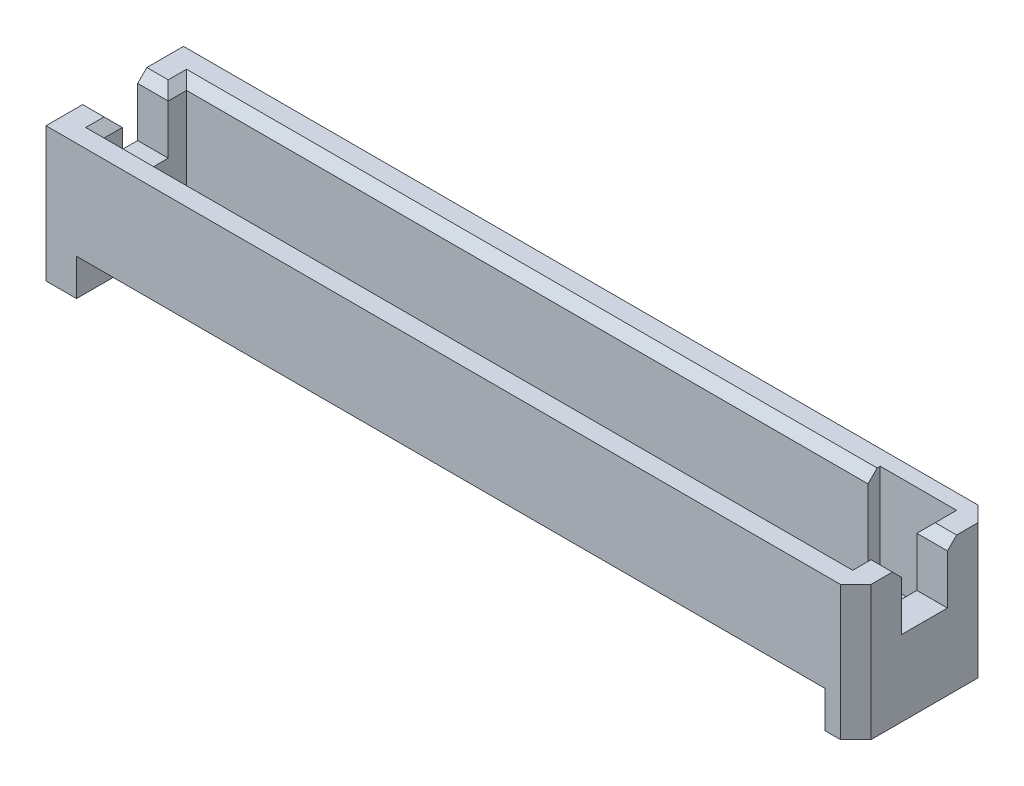
ISO-10303-21;
HEADER;
FILE_DESCRIPTION(('STEP AP214'),'2;1');
FILE_NAME('part.step','',(''),(''),'','','');
FILE_SCHEMA(('AUTOMOTIVE_DESIGN { 1 0 10303 214 1 1 1 1 }'));
ENDSEC;
DATA;
#1=APPLICATION_CONTEXT('core data for automotive mechanical design processes');
#2=APPLICATION_PROTOCOL_DEFINITION('international standard','automotive_design',2000,#1);
#3=PRODUCT_CONTEXT('',#1,'mechanical');
#4=PRODUCT('Part','Part','',(#3));
#5=PRODUCT_RELATED_PRODUCT_CATEGORY('part','',(#4));
#6=PRODUCT_DEFINITION_FORMATION('','',#4);
#7=PRODUCT_DEFINITION_CONTEXT('part definition',#1,'design');
#8=PRODUCT_DEFINITION('design','',#6,#7);
#9=PRODUCT_DEFINITION_SHAPE('','',#8);
#10=(LENGTH_UNIT() NAMED_UNIT(*) SI_UNIT(.MILLI.,.METRE.));
#11=(NAMED_UNIT(*) PLANE_ANGLE_UNIT() SI_UNIT($,.RADIAN.));
#12=(NAMED_UNIT(*) SI_UNIT($,.STERADIAN.) SOLID_ANGLE_UNIT());
#13=UNCERTAINTY_MEASURE_WITH_UNIT(LENGTH_MEASURE(1.E-05),#10,'distance_accuracy_value','');
#14=(GEOMETRIC_REPRESENTATION_CONTEXT(3) GLOBAL_UNCERTAINTY_ASSIGNED_CONTEXT((#13)) GLOBAL_UNIT_ASSIGNED_CONTEXT((#10,
#11,#12)) REPRESENTATION_CONTEXT('',''));
#15=CARTESIAN_POINT('',(0.,0.,0.));
#16=DIRECTION('',(0.,0.,1.));
#17=DIRECTION('',(1.,0.,0.));
#18=AXIS2_PLACEMENT_3D('',#15,#16,#17);
#19=CARTESIAN_POINT('',(16.1925,5.588,2.8575));
#20=DIRECTION('',(-0.707106781186545,0.,-0.70710678118655));
#21=DIRECTION('',(-0.70710678118655,0.,0.707106781186545));
#22=AXIS2_PLACEMENT_3D('',#19,#20,#21);
#23=PLANE('',#22);
#24=DIRECTION('',(0.70710678118655,0.,-0.707106781186545));
#25=VECTOR('',#24,1.);
#26=CARTESIAN_POINT('',(16.1925,0.,2.8575));
#27=LINE('',#26,#25);
#28=CARTESIAN_POINT('',(16.1925,0.,2.8575));
#29=VERTEX_POINT('',#28);
#30=CARTESIAN_POINT('',(16.8275,0.,2.2225));
#31=VERTEX_POINT('',#30);
#32=EDGE_CURVE('E11',#29,#31,#27,.T.);
#33=ORIENTED_EDGE('',*,*,#32,.T.);
#34=DIRECTION('',(0.,-1.,0.));
#35=VECTOR('',#34,1.);
#36=CARTESIAN_POINT('',(16.8275,5.588,2.2225));
#37=LINE('',#36,#35);
#38=CARTESIAN_POINT('',(16.8275,5.588,2.2225));
#39=VERTEX_POINT('',#38);
#40=EDGE_CURVE('E25',#39,#31,#37,.T.);
#41=ORIENTED_EDGE('',*,*,#40,.F.);
#42=DIRECTION('',(0.70710678118655,0.,-0.707106781186545));
#43=VECTOR('',#42,1.);
#44=CARTESIAN_POINT('',(16.1925,5.588,2.8575));
#45=LINE('',#44,#43);
#46=CARTESIAN_POINT('',(16.1925,5.588,2.8575));
#47=VERTEX_POINT('',#46);
#48=EDGE_CURVE('E661',#47,#39,#45,.T.);
#49=ORIENTED_EDGE('',*,*,#48,.F.);
#50=DIRECTION('',(0.,-1.,0.));
#51=VECTOR('',#50,1.);
#52=CARTESIAN_POINT('',(16.1925,5.588,2.8575));
#53=LINE('',#52,#51);
#54=EDGE_CURVE('E657',#47,#29,#53,.T.);
#55=ORIENTED_EDGE('',*,*,#54,.T.);
#56=EDGE_LOOP('',(#33,#41,#49,#55));
#57=FACE_BOUND('',#56,.T.);
#58=ADVANCED_FACE('F17',(#57),#23,.F.);
#59=CARTESIAN_POINT('',(-16.8275,5.588,2.8575));
#60=DIRECTION('',(0.,0.,-1.));
#61=DIRECTION('',(-1.,0.,0.));
#62=AXIS2_PLACEMENT_3D('',#59,#60,#61);
#63=PLANE('',#62);
#64=DIRECTION('',(-1.,0.,0.));
#65=VECTOR('',#64,1.);
#66=CARTESIAN_POINT('',(15.5575,1.524,2.8575));
#67=LINE('',#66,#65);
#68=CARTESIAN_POINT('',(15.5575,1.524,2.8575));
#69=VERTEX_POINT('',#68);
#70=CARTESIAN_POINT('',(-15.5575,1.524,2.8575));
#71=VERTEX_POINT('',#70);
#72=EDGE_CURVE('E652',#69,#71,#67,.T.);
#73=ORIENTED_EDGE('',*,*,#72,.F.);
#74=DIRECTION('',(0.,-1.,0.));
#75=VECTOR('',#74,1.);
#76=CARTESIAN_POINT('',(15.5575,1.524,2.8575));
#77=LINE('',#76,#75);
#78=CARTESIAN_POINT('',(15.5575,0.,2.8575));
#79=VERTEX_POINT('',#78);
#80=EDGE_CURVE('E648',#69,#79,#77,.T.);
#81=ORIENTED_EDGE('',*,*,#80,.T.);
#82=DIRECTION('',(1.,0.,0.));
#83=VECTOR('',#82,1.);
#84=CARTESIAN_POINT('',(-16.8275,0.,2.8575));
#85=LINE('',#84,#83);
#86=EDGE_CURVE('E643',#79,#29,#85,.T.);
#87=ORIENTED_EDGE('',*,*,#86,.T.);
#88=ORIENTED_EDGE('',*,*,#54,.F.);
#89=DIRECTION('',(1.,0.,0.));
#90=VECTOR('',#89,1.);
#91=CARTESIAN_POINT('',(-16.8275,5.588,2.8575));
#92=LINE('',#91,#90);
#93=CARTESIAN_POINT('',(-16.8275,5.588,2.8575));
#94=VERTEX_POINT('',#93);
#95=EDGE_CURVE('E638',#94,#47,#92,.T.);
#96=ORIENTED_EDGE('',*,*,#95,.F.);
#97=DIRECTION('',(0.,-1.,0.));
#98=VECTOR('',#97,1.);
#99=CARTESIAN_POINT('',(-16.8275,5.588,2.8575));
#100=LINE('',#99,#98);
#101=CARTESIAN_POINT('',(-16.8275,0.,2.8575));
#102=VERTEX_POINT('',#101);
#103=EDGE_CURVE('E634',#94,#102,#100,.T.);
#104=ORIENTED_EDGE('',*,*,#103,.T.);
#105=DIRECTION('',(1.,0.,0.));
#106=VECTOR('',#105,1.);
#107=CARTESIAN_POINT('',(-16.8275,0.,2.8575));
#108=LINE('',#107,#106);
#109=CARTESIAN_POINT('',(-15.5575,0.,2.8575));
#110=VERTEX_POINT('',#109);
#111=EDGE_CURVE('E630',#102,#110,#108,.T.);
#112=ORIENTED_EDGE('',*,*,#111,.T.);
#113=DIRECTION('',(0.,-1.,0.));
#114=VECTOR('',#113,1.);
#115=CARTESIAN_POINT('',(-15.5575,1.524,2.8575));
#116=LINE('',#115,#114);
#117=EDGE_CURVE('E625',#71,#110,#116,.T.);
#118=ORIENTED_EDGE('',*,*,#117,.F.);
#119=EDGE_LOOP('',(#73,#81,#87,#88,#96,#104,#112,#118));
#120=FACE_BOUND('',#119,.T.);
#121=ADVANCED_FACE('F677',(#120),#63,.F.);
#122=CARTESIAN_POINT('',(-15.5575,0.,0.));
#123=DIRECTION('',(1.,0.,0.));
#124=DIRECTION('',(0.,0.,-1.));
#125=AXIS2_PLACEMENT_3D('',#122,#123,#124);
#126=PLANE('',#125);
#127=DIRECTION('',(0.,0.496138938356834,0.868243142124459));
#128=VECTOR('',#127,1.);
#129=CARTESIAN_POINT('',(-15.5575,0.508,1.0795));
#130=LINE('',#129,#128);
#131=CARTESIAN_POINT('',(-15.5575,0.508,1.0795));
#132=VERTEX_POINT('',#131);
#133=EDGE_CURVE('E620',#132,#71,#130,.T.);
#134=ORIENTED_EDGE('',*,*,#133,.T.);
#135=ORIENTED_EDGE('',*,*,#117,.T.);
#136=DIRECTION('',(0.,0.,-1.));
#137=VECTOR('',#136,1.);
#138=CARTESIAN_POINT('',(-15.5575,0.,2.8575));
#139=LINE('',#138,#137);
#140=CARTESIAN_POINT('',(-15.5575,0.,-2.8575));
#141=VERTEX_POINT('',#140);
#142=EDGE_CURVE('E616',#110,#141,#139,.T.);
#143=ORIENTED_EDGE('',*,*,#142,.T.);
#144=DIRECTION('',(0.,1.,0.));
#145=VECTOR('',#144,1.);
#146=CARTESIAN_POINT('',(-15.5575,0.,-2.8575));
#147=LINE('',#146,#145);
#148=CARTESIAN_POINT('',(-15.5575,1.524,-2.8575));
#149=VERTEX_POINT('',#148);
#150=EDGE_CURVE('E612',#141,#149,#147,.T.);
#151=ORIENTED_EDGE('',*,*,#150,.T.);
#152=DIRECTION('',(0.,-0.496138938356834,0.868243142124459));
#153=VECTOR('',#152,1.);
#154=CARTESIAN_POINT('',(-15.5575,1.524,-2.8575));
#155=LINE('',#154,#153);
#156=CARTESIAN_POINT('',(-15.5575,0.508,-1.0795));
#157=VERTEX_POINT('',#156);
#158=EDGE_CURVE('E608',#149,#157,#155,.T.);
#159=ORIENTED_EDGE('',*,*,#158,.T.);
#160=DIRECTION('',(0.,0.,1.));
#161=VECTOR('',#160,1.);
#162=CARTESIAN_POINT('',(-15.5575,0.508,-1.0795));
#163=LINE('',#162,#161);
#164=EDGE_CURVE('E604',#157,#132,#163,.T.);
#165=ORIENTED_EDGE('',*,*,#164,.T.);
#166=EDGE_LOOP('',(#134,#135,#143,#151,#159,#165));
#167=FACE_BOUND('',#166,.T.);
#168=ADVANCED_FACE('F807',(#167),#126,.T.);
#169=CARTESIAN_POINT('',(15.5575,0.508,-1.0795));
#170=DIRECTION('',(0.,-1.,0.));
#171=DIRECTION('',(0.,0.,-1.));
#172=AXIS2_PLACEMENT_3D('',#169,#170,#171);
#173=PLANE('',#172);
#174=ORIENTED_EDGE('',*,*,#164,.F.);
#175=DIRECTION('',(-1.,0.,0.));
#176=VECTOR('',#175,1.);
#177=CARTESIAN_POINT('',(15.5575,0.508,-1.0795));
#178=LINE('',#177,#176);
#179=CARTESIAN_POINT('',(15.5575,0.508,-1.0795));
#180=VERTEX_POINT('',#179);
#181=EDGE_CURVE('E599',#180,#157,#178,.T.);
#182=ORIENTED_EDGE('',*,*,#181,.F.);
#183=DIRECTION('',(0.,0.,1.));
#184=VECTOR('',#183,1.);
#185=CARTESIAN_POINT('',(15.5575,0.508,-1.0795));
#186=LINE('',#185,#184);
#187=CARTESIAN_POINT('',(15.5575,0.508,1.0795));
#188=VERTEX_POINT('',#187);
#189=EDGE_CURVE('E595',#180,#188,#186,.T.);
#190=ORIENTED_EDGE('',*,*,#189,.T.);
#191=DIRECTION('',(-1.,0.,0.));
#192=VECTOR('',#191,1.);
#193=CARTESIAN_POINT('',(15.5575,0.508,1.0795));
#194=LINE('',#193,#192);
#195=EDGE_CURVE('E590',#188,#132,#194,.T.);
#196=ORIENTED_EDGE('',*,*,#195,.T.);
#197=EDGE_LOOP('',(#174,#182,#190,#196));
#198=FACE_BOUND('',#197,.T.);
#199=ADVANCED_FACE('F811',(#198),#173,.T.);
#200=CARTESIAN_POINT('',(15.5575,0.508,1.0795));
#201=DIRECTION('',(0.,-0.868243142124459,0.496138938356834));
#202=DIRECTION('',(0.,-0.496138938356834,-0.868243142124459));
#203=AXIS2_PLACEMENT_3D('',#200,#201,#202);
#204=PLANE('',#203);
#205=ORIENTED_EDGE('',*,*,#133,.F.);
#206=ORIENTED_EDGE('',*,*,#195,.F.);
#207=DIRECTION('',(0.,0.496138938356834,0.868243142124459));
#208=VECTOR('',#207,1.);
#209=CARTESIAN_POINT('',(15.5575,0.508,1.0795));
#210=LINE('',#209,#208);
#211=EDGE_CURVE('E585',#188,#69,#210,.T.);
#212=ORIENTED_EDGE('',*,*,#211,.T.);
#213=ORIENTED_EDGE('',*,*,#72,.T.);
#214=EDGE_LOOP('',(#205,#206,#212,#213));
#215=FACE_BOUND('',#214,.T.);
#216=ADVANCED_FACE('F817',(#215),#204,.T.);
#217=CARTESIAN_POINT('',(15.5575,0.,0.));
#218=DIRECTION('',(1.,0.,0.));
#219=DIRECTION('',(0.,0.,-1.));
#220=AXIS2_PLACEMENT_3D('',#217,#218,#219);
#221=PLANE('',#220);
#222=ORIENTED_EDGE('',*,*,#211,.F.);
#223=ORIENTED_EDGE('',*,*,#189,.F.);
#224=DIRECTION('',(0.,-0.496138938356834,0.868243142124459));
#225=VECTOR('',#224,1.);
#226=CARTESIAN_POINT('',(15.5575,1.524,-2.8575));
#227=LINE('',#226,#225);
#228=CARTESIAN_POINT('',(15.5575,1.524,-2.8575));
#229=VERTEX_POINT('',#228);
#230=EDGE_CURVE('E580',#229,#180,#227,.T.);
#231=ORIENTED_EDGE('',*,*,#230,.F.);
#232=DIRECTION('',(0.,1.,0.));
#233=VECTOR('',#232,1.);
#234=CARTESIAN_POINT('',(15.5575,0.,-2.8575));
#235=LINE('',#234,#233);
#236=CARTESIAN_POINT('',(15.5575,0.,-2.8575));
#237=VERTEX_POINT('',#236);
#238=EDGE_CURVE('E575',#237,#229,#235,.T.);
#239=ORIENTED_EDGE('',*,*,#238,.F.);
#240=DIRECTION('',(0.,0.,-1.));
#241=VECTOR('',#240,1.);
#242=CARTESIAN_POINT('',(15.5575,0.,2.8575));
#243=LINE('',#242,#241);
#244=EDGE_CURVE('E570',#79,#237,#243,.T.);
#245=ORIENTED_EDGE('',*,*,#244,.F.);
#246=ORIENTED_EDGE('',*,*,#80,.F.);
#247=EDGE_LOOP('',(#222,#223,#231,#239,#245,#246));
#248=FACE_BOUND('',#247,.T.);
#249=ADVANCED_FACE('F821',(#248),#221,.F.);
#250=CARTESIAN_POINT('',(0.,0.,0.));
#251=DIRECTION('',(0.,1.,0.));
#252=DIRECTION('',(0.,0.,1.));
#253=AXIS2_PLACEMENT_3D('',#250,#251,#252);
#254=PLANE('',#253);
#255=ORIENTED_EDGE('',*,*,#86,.F.);
#256=ORIENTED_EDGE('',*,*,#244,.T.);
#257=DIRECTION('',(-1.,0.,0.));
#258=VECTOR('',#257,1.);
#259=CARTESIAN_POINT('',(16.1925,0.,-2.8575));
#260=LINE('',#259,#258);
#261=CARTESIAN_POINT('',(16.1925,0.,-2.8575));
#262=VERTEX_POINT('',#261);
#263=EDGE_CURVE('E565',#262,#237,#260,.T.);
#264=ORIENTED_EDGE('',*,*,#263,.F.);
#265=DIRECTION('',(-0.70710678118655,0.,-0.707106781186545));
#266=VECTOR('',#265,1.);
#267=CARTESIAN_POINT('',(16.8275,0.,-2.2225));
#268=LINE('',#267,#266);
#269=CARTESIAN_POINT('',(16.8275,0.,-2.2225));
#270=VERTEX_POINT('',#269);
#271=EDGE_CURVE('E560',#270,#262,#268,.T.);
#272=ORIENTED_EDGE('',*,*,#271,.F.);
#273=DIRECTION('',(0.,0.,-1.));
#274=VECTOR('',#273,1.);
#275=CARTESIAN_POINT('',(16.8275,0.,2.2225));
#276=LINE('',#275,#274);
#277=EDGE_CURVE('E555',#31,#270,#276,.T.);
#278=ORIENTED_EDGE('',*,*,#277,.F.);
#279=ORIENTED_EDGE('',*,*,#32,.F.);
#280=EDGE_LOOP('',(#255,#256,#264,#272,#278,#279));
#281=FACE_BOUND('',#280,.T.);
#282=ADVANCED_FACE('F682',(#281),#254,.F.);
#283=CARTESIAN_POINT('',(16.8275,5.588,2.2225));
#284=DIRECTION('',(-1.,0.,0.));
#285=DIRECTION('',(0.,0.,1.));
#286=AXIS2_PLACEMENT_3D('',#283,#284,#285);
#287=PLANE('',#286);
#288=DIRECTION('',(0.,-0.707106781186548,-0.707106781186547));
#289=VECTOR('',#288,1.);
#290=CARTESIAN_POINT('',(16.8275,5.588,1.3335));
#291=LINE('',#290,#289);
#292=CARTESIAN_POINT('',(16.8275,5.588,1.3335));
#293=VERTEX_POINT('',#292);
#294=CARTESIAN_POINT('',(16.8275,5.207,0.9525));
#295=VERTEX_POINT('',#294);
#296=EDGE_CURVE('E550',#293,#295,#291,.T.);
#297=ORIENTED_EDGE('',*,*,#296,.F.);
#298=DIRECTION('',(0.,0.,-1.));
#299=VECTOR('',#298,1.);
#300=CARTESIAN_POINT('',(16.8275,5.588,2.2225));
#301=LINE('',#300,#299);
#302=EDGE_CURVE('E545',#39,#293,#301,.T.);
#303=ORIENTED_EDGE('',*,*,#302,.F.);
#304=ORIENTED_EDGE('',*,*,#40,.T.);
#305=ORIENTED_EDGE('',*,*,#277,.T.);
#306=DIRECTION('',(0.,-1.,0.));
#307=VECTOR('',#306,1.);
#308=CARTESIAN_POINT('',(16.8275,5.588,-2.2225));
#309=LINE('',#308,#307);
#310=CARTESIAN_POINT('',(16.8275,5.588,-2.2225));
#311=VERTEX_POINT('',#310);
#312=EDGE_CURVE('E540',#311,#270,#309,.T.);
#313=ORIENTED_EDGE('',*,*,#312,.F.);
#314=DIRECTION('',(0.,0.,-1.));
#315=VECTOR('',#314,1.);
#316=CARTESIAN_POINT('',(16.8275,5.588,2.2225));
#317=LINE('',#316,#315);
#318=CARTESIAN_POINT('',(16.8275,5.588,-1.3335));
#319=VERTEX_POINT('',#318);
#320=EDGE_CURVE('E535',#319,#311,#317,.T.);
#321=ORIENTED_EDGE('',*,*,#320,.F.);
#322=DIRECTION('',(0.,0.707106781186548,-0.707106781186547));
#323=VECTOR('',#322,1.);
#324=CARTESIAN_POINT('',(16.8275,5.207,-0.9525));
#325=LINE('',#324,#323);
#326=CARTESIAN_POINT('',(16.8275,5.207,-0.9525));
#327=VERTEX_POINT('',#326);
#328=EDGE_CURVE('E530',#327,#319,#325,.T.);
#329=ORIENTED_EDGE('',*,*,#328,.F.);
#330=DIRECTION('',(0.,-1.,0.));
#331=VECTOR('',#330,1.);
#332=CARTESIAN_POINT('',(16.8275,8.0264,-0.9525));
#333=LINE('',#332,#331);
#334=CARTESIAN_POINT('',(16.8275,3.1496,-0.9525));
#335=VERTEX_POINT('',#334);
#336=EDGE_CURVE('E526',#327,#335,#333,.T.);
#337=ORIENTED_EDGE('',*,*,#336,.T.);
#338=DIRECTION('',(0.,0.,-1.));
#339=VECTOR('',#338,1.);
#340=CARTESIAN_POINT('',(16.8275,3.1496,0.9525));
#341=LINE('',#340,#339);
#342=CARTESIAN_POINT('',(16.8275,3.1496,0.9525));
#343=VERTEX_POINT('',#342);
#344=EDGE_CURVE('E521',#343,#335,#341,.T.);
#345=ORIENTED_EDGE('',*,*,#344,.F.);
#346=DIRECTION('',(0.,-1.,0.));
#347=VECTOR('',#346,1.);
#348=CARTESIAN_POINT('',(16.8275,8.0264,0.9525));
#349=LINE('',#348,#347);
#350=EDGE_CURVE('E516',#295,#343,#349,.T.);
#351=ORIENTED_EDGE('',*,*,#350,.F.);
#352=EDGE_LOOP('',(#297,#303,#304,#305,#313,#321,#329,#337,#345,#351));
#353=FACE_BOUND('',#352,.T.);
#354=ADVANCED_FACE('F671',(#353),#287,.F.);
#355=CARTESIAN_POINT('',(-16.8275,8.0264,0.9525));
#356=DIRECTION('',(0.,0.,-1.));
#357=DIRECTION('',(-1.,0.,0.));
#358=AXIS2_PLACEMENT_3D('',#355,#356,#357);
#359=PLANE('',#358);
#360=DIRECTION('',(0.,-1.,0.));
#361=VECTOR('',#360,1.);
#362=CARTESIAN_POINT('',(15.5575,8.0264,0.9525));
#363=LINE('',#362,#361);
#364=CARTESIAN_POINT('',(15.5575,5.207,0.9525));
#365=VERTEX_POINT('',#364);
#366=CARTESIAN_POINT('',(15.5575,3.1496,0.9525));
#367=VERTEX_POINT('',#366);
#368=EDGE_CURVE('E511',#365,#367,#363,.T.);
#369=ORIENTED_EDGE('',*,*,#368,.F.);
#370=DIRECTION('',(-1.,0.,0.));
#371=VECTOR('',#370,1.);
#372=CARTESIAN_POINT('',(16.8275,5.207,0.9525));
#373=LINE('',#372,#371);
#374=EDGE_CURVE('E506',#295,#365,#373,.T.);
#375=ORIENTED_EDGE('',*,*,#374,.F.);
#376=ORIENTED_EDGE('',*,*,#350,.T.);
#377=DIRECTION('',(1.,0.,0.));
#378=VECTOR('',#377,1.);
#379=CARTESIAN_POINT('',(-16.8275,3.1496,0.9525));
#380=LINE('',#379,#378);
#381=EDGE_CURVE('E501',#367,#343,#380,.T.);
#382=ORIENTED_EDGE('',*,*,#381,.F.);
#383=EDGE_LOOP('',(#369,#375,#376,#382));
#384=FACE_BOUND('',#383,.T.);
#385=ADVANCED_FACE('F791',(#384),#359,.T.);
#386=CARTESIAN_POINT('',(0.,3.1496,0.));
#387=DIRECTION('',(0.,1.,0.));
#388=DIRECTION('',(0.,0.,1.));
#389=AXIS2_PLACEMENT_3D('',#386,#387,#388);
#390=PLANE('',#389);
#391=DIRECTION('',(0.,0.,-1.));
#392=VECTOR('',#391,1.);
#393=CARTESIAN_POINT('',(15.5575,3.1496,0.));
#394=LINE('',#393,#392);
#395=CARTESIAN_POINT('',(15.5575,3.1496,-0.9525));
#396=VERTEX_POINT('',#395);
#397=EDGE_CURVE('E496',#367,#396,#394,.T.);
#398=ORIENTED_EDGE('',*,*,#397,.F.);
#399=ORIENTED_EDGE('',*,*,#381,.T.);
#400=ORIENTED_EDGE('',*,*,#344,.T.);
#401=DIRECTION('',(-1.,0.,0.));
#402=VECTOR('',#401,1.);
#403=CARTESIAN_POINT('',(16.8275,3.1496,-0.9525));
#404=LINE('',#403,#402);
#405=EDGE_CURVE('E492',#335,#396,#404,.T.);
#406=ORIENTED_EDGE('',*,*,#405,.T.);
#407=EDGE_LOOP('',(#398,#399,#400,#406));
#408=FACE_BOUND('',#407,.T.);
#409=ADVANCED_FACE('F793',(#408),#390,.T.);
#410=CARTESIAN_POINT('',(16.8275,8.0264,-0.9525));
#411=DIRECTION('',(0.,0.,1.));
#412=DIRECTION('',(1.,0.,0.));
#413=AXIS2_PLACEMENT_3D('',#410,#411,#412);
#414=PLANE('',#413);
#415=ORIENTED_EDGE('',*,*,#336,.F.);
#416=DIRECTION('',(-1.,0.,0.));
#417=VECTOR('',#416,1.);
#418=CARTESIAN_POINT('',(16.8275,5.207,-0.9525));
#419=LINE('',#418,#417);
#420=CARTESIAN_POINT('',(15.5575,5.207,-0.9525));
#421=VERTEX_POINT('',#420);
#422=EDGE_CURVE('E488',#327,#421,#419,.T.);
#423=ORIENTED_EDGE('',*,*,#422,.T.);
#424=DIRECTION('',(0.,1.,0.));
#425=VECTOR('',#424,1.);
#426=CARTESIAN_POINT('',(15.5575,8.0264,-0.9525));
#427=LINE('',#426,#425);
#428=EDGE_CURVE('E483',#396,#421,#427,.T.);
#429=ORIENTED_EDGE('',*,*,#428,.F.);
#430=ORIENTED_EDGE('',*,*,#405,.F.);
#431=EDGE_LOOP('',(#415,#423,#429,#430));
#432=FACE_BOUND('',#431,.T.);
#433=ADVANCED_FACE('F698',(#432),#414,.T.);
#434=CARTESIAN_POINT('',(15.5575,1.4351,1.7145));
#435=DIRECTION('',(1.,0.,0.));
#436=DIRECTION('',(0.,0.,-1.));
#437=AXIS2_PLACEMENT_3D('',#434,#435,#436);
#438=PLANE('',#437);
#439=ORIENTED_EDGE('',*,*,#397,.T.);
#440=ORIENTED_EDGE('',*,*,#428,.T.);
#441=DIRECTION('',(0.,0.,-1.));
#442=VECTOR('',#441,1.);
#443=CARTESIAN_POINT('',(15.5575,5.207,1.7145));
#444=LINE('',#443,#442);
#445=CARTESIAN_POINT('',(15.5575,5.207,-2.2225));
#446=VERTEX_POINT('',#445);
#447=EDGE_CURVE('E479',#421,#446,#444,.T.);
#448=ORIENTED_EDGE('',*,*,#447,.T.);
#449=DIRECTION('',(0.,1.,0.));
#450=VECTOR('',#449,1.);
#451=CARTESIAN_POINT('',(15.5575,1.4351,-2.2225));
#452=LINE('',#451,#450);
#453=CARTESIAN_POINT('',(15.5575,1.4351,-2.2225));
#454=VERTEX_POINT('',#453);
#455=EDGE_CURVE('E475',#454,#446,#452,.T.);
#456=ORIENTED_EDGE('',*,*,#455,.F.);
#457=DIRECTION('',(0.,0.,-1.));
#458=VECTOR('',#457,1.);
#459=CARTESIAN_POINT('',(15.5575,1.4351,1.7145));
#460=LINE('',#459,#458);
#461=CARTESIAN_POINT('',(15.5575,1.4351,1.7145));
#462=VERTEX_POINT('',#461);
#463=EDGE_CURVE('E233',#462,#454,#460,.T.);
#464=ORIENTED_EDGE('',*,*,#463,.F.);
#465=DIRECTION('',(0.,1.,0.));
#466=VECTOR('',#465,1.);
#467=CARTESIAN_POINT('',(15.5575,1.4351,1.7145));
#468=LINE('',#467,#466);
#469=CARTESIAN_POINT('',(15.5575,5.207,1.7145));
#470=VERTEX_POINT('',#469);
#471=EDGE_CURVE('E468',#462,#470,#468,.T.);
#472=ORIENTED_EDGE('',*,*,#471,.T.);
#473=DIRECTION('',(0.,0.,-1.));
#474=VECTOR('',#473,1.);
#475=CARTESIAN_POINT('',(15.5575,5.207,1.7145));
#476=LINE('',#475,#474);
#477=EDGE_CURVE('E463',#470,#365,#476,.T.);
#478=ORIENTED_EDGE('',*,*,#477,.T.);
#479=ORIENTED_EDGE('',*,*,#368,.T.);
#480=EDGE_LOOP('',(#439,#440,#448,#456,#464,#472,#478,#479));
#481=FACE_BOUND('',#480,.T.);
#482=ADVANCED_FACE('F702',(#481),#438,.F.);
#483=CARTESIAN_POINT('',(15.5575,5.207,1.7145));
#484=DIRECTION('',(-0.707106781186548,0.707106781186548,0.));
#485=DIRECTION('',(-0.707106781186548,-0.707106781186548,0.));
#486=AXIS2_PLACEMENT_3D('',#483,#484,#485);
#487=PLANE('',#486);
#488=DIRECTION('',(0.,0.,-1.));
#489=VECTOR('',#488,1.);
#490=CARTESIAN_POINT('',(15.9385,5.588,1.7145));
#491=LINE('',#490,#489);
#492=CARTESIAN_POINT('',(15.9385,5.588,2.0955));
#493=VERTEX_POINT('',#492);
#494=CARTESIAN_POINT('',(15.9385,5.588,1.3335));
#495=VERTEX_POINT('',#494);
#496=EDGE_CURVE('E459',#493,#495,#491,.T.);
#497=ORIENTED_EDGE('',*,*,#496,.T.);
#498=DIRECTION('',(-0.577350269189626,-0.577350269189626,-0.577350269189625));
#499=VECTOR('',#498,1.);
#500=CARTESIAN_POINT('',(15.8115,5.461,1.2065));
#501=LINE('',#500,#499);
#502=EDGE_CURVE('E454',#495,#365,#501,.T.);
#503=ORIENTED_EDGE('',*,*,#502,.T.);
#504=ORIENTED_EDGE('',*,*,#477,.F.);
#505=DIRECTION('',(-0.577350269189626,-0.577350269189626,-0.577350269189626));
#506=VECTOR('',#505,1.);
#507=CARTESIAN_POINT('',(15.5575,5.207,1.7145));
#508=LINE('',#507,#506);
#509=EDGE_CURVE('E449',#493,#470,#508,.T.);
#510=ORIENTED_EDGE('',*,*,#509,.F.);
#511=EDGE_LOOP('',(#497,#503,#504,#510));
#512=FACE_BOUND('',#511,.T.);
#513=ADVANCED_FACE('F788',(#512),#487,.T.);
#514=CARTESIAN_POINT('',(-15.5575,5.207,1.7145));
#515=DIRECTION('',(0.,0.707106781186548,-0.707106781186547));
#516=DIRECTION('',(0.,0.707106781186547,0.707106781186548));
#517=AXIS2_PLACEMENT_3D('',#514,#515,#516);
#518=PLANE('',#517);
#519=DIRECTION('',(1.,0.,0.));
#520=VECTOR('',#519,1.);
#521=CARTESIAN_POINT('',(-15.5575,5.207,1.7145));
#522=LINE('',#521,#520);
#523=CARTESIAN_POINT('',(-15.5575,5.207,1.7145));
#524=VERTEX_POINT('',#523);
#525=EDGE_CURVE('E444',#524,#470,#522,.T.);
#526=ORIENTED_EDGE('',*,*,#525,.F.);
#527=DIRECTION('',(0.577350269189626,-0.577350269189626,-0.577350269189626));
#528=VECTOR('',#527,1.);
#529=CARTESIAN_POINT('',(-15.5575,5.207,1.7145));
#530=LINE('',#529,#528);
#531=CARTESIAN_POINT('',(-15.9385,5.588,2.0955));
#532=VERTEX_POINT('',#531);
#533=EDGE_CURVE('E439',#532,#524,#530,.T.);
#534=ORIENTED_EDGE('',*,*,#533,.F.);
#535=DIRECTION('',(1.,0.,0.));
#536=VECTOR('',#535,1.);
#537=CARTESIAN_POINT('',(-15.5575,5.588,2.0955));
#538=LINE('',#537,#536);
#539=EDGE_CURVE('E434',#532,#493,#538,.T.);
#540=ORIENTED_EDGE('',*,*,#539,.T.);
#541=ORIENTED_EDGE('',*,*,#509,.T.);
#542=EDGE_LOOP('',(#526,#534,#540,#541));
#543=FACE_BOUND('',#542,.T.);
#544=ADVANCED_FACE('F714',(#543),#518,.T.);
#545=CARTESIAN_POINT('',(0.,5.588,0.));
#546=DIRECTION('',(0.,1.,0.));
#547=DIRECTION('',(0.,0.,1.));
#548=AXIS2_PLACEMENT_3D('',#545,#546,#547);
#549=PLANE('',#548);
#550=ORIENTED_EDGE('',*,*,#302,.T.);
#551=DIRECTION('',(-1.,0.,0.));
#552=VECTOR('',#551,1.);
#553=CARTESIAN_POINT('',(16.8275,5.588,1.3335));
#554=LINE('',#553,#552);
#555=EDGE_CURVE('E429',#293,#495,#554,.T.);
#556=ORIENTED_EDGE('',*,*,#555,.T.);
#557=ORIENTED_EDGE('',*,*,#496,.F.);
#558=ORIENTED_EDGE('',*,*,#539,.F.);
#559=DIRECTION('',(0.,0.,1.));
#560=VECTOR('',#559,1.);
#561=CARTESIAN_POINT('',(-15.9385,5.588,-1.7145));
#562=LINE('',#561,#560);
#563=CARTESIAN_POINT('',(-15.9385,5.588,1.3335));
#564=VERTEX_POINT('',#563);
#565=EDGE_CURVE('E424',#564,#532,#562,.T.);
#566=ORIENTED_EDGE('',*,*,#565,.F.);
#567=DIRECTION('',(-1.,0.,0.));
#568=VECTOR('',#567,1.);
#569=CARTESIAN_POINT('',(16.8275,5.588,1.3335));
#570=LINE('',#569,#568);
#571=CARTESIAN_POINT('',(-16.8275,5.588,1.3335));
#572=VERTEX_POINT('',#571);
#573=EDGE_CURVE('E420',#564,#572,#570,.T.);
#574=ORIENTED_EDGE('',*,*,#573,.T.);
#575=DIRECTION('',(0.,0.,1.));
#576=VECTOR('',#575,1.);
#577=CARTESIAN_POINT('',(-16.8275,5.588,-2.8575));
#578=LINE('',#577,#576);
#579=EDGE_CURVE('E415',#572,#94,#578,.T.);
#580=ORIENTED_EDGE('',*,*,#579,.T.);
#581=ORIENTED_EDGE('',*,*,#95,.T.);
#582=ORIENTED_EDGE('',*,*,#48,.T.);
#583=EDGE_LOOP('',(#550,#556,#557,#558,#566,#574,#580,#581,#582));
#584=FACE_BOUND('',#583,.T.);
#585=ADVANCED_FACE('F674',(#584),#549,.T.);
#586=CARTESIAN_POINT('',(-16.8275,5.588,-2.8575));
#587=DIRECTION('',(1.,0.,0.));
#588=DIRECTION('',(0.,0.,-1.));
#589=AXIS2_PLACEMENT_3D('',#586,#587,#588);
#590=PLANE('',#589);
#591=DIRECTION('',(0.,-0.707106781186548,-0.707106781186547));
#592=VECTOR('',#591,1.);
#593=CARTESIAN_POINT('',(-16.8275,5.588,1.3335));
#594=LINE('',#593,#592);
#595=CARTESIAN_POINT('',(-16.8275,5.207,0.9525));
#596=VERTEX_POINT('',#595);
#597=EDGE_CURVE('E411',#572,#596,#594,.T.);
#598=ORIENTED_EDGE('',*,*,#597,.T.);
#599=DIRECTION('',(0.,-1.,0.));
#600=VECTOR('',#599,1.);
#601=CARTESIAN_POINT('',(-16.8275,8.0264,0.9525));
#602=LINE('',#601,#600);
#603=CARTESIAN_POINT('',(-16.8275,3.1496,0.9525));
#604=VERTEX_POINT('',#603);
#605=EDGE_CURVE('E407',#596,#604,#602,.T.);
#606=ORIENTED_EDGE('',*,*,#605,.T.);
#607=DIRECTION('',(0.,0.,1.));
#608=VECTOR('',#607,1.);
#609=CARTESIAN_POINT('',(-16.8275,3.1496,-0.9525));
#610=LINE('',#609,#608);
#611=CARTESIAN_POINT('',(-16.8275,3.1496,-0.9525));
#612=VERTEX_POINT('',#611);
#613=EDGE_CURVE('E402',#612,#604,#610,.T.);
#614=ORIENTED_EDGE('',*,*,#613,.F.);
#615=DIRECTION('',(0.,-1.,0.));
#616=VECTOR('',#615,1.);
#617=CARTESIAN_POINT('',(-16.8275,8.0264,-0.9525));
#618=LINE('',#617,#616);
#619=CARTESIAN_POINT('',(-16.8275,5.207,-0.9525));
#620=VERTEX_POINT('',#619);
#621=EDGE_CURVE('E397',#620,#612,#618,.T.);
#622=ORIENTED_EDGE('',*,*,#621,.F.);
#623=DIRECTION('',(0.,0.707106781186548,-0.707106781186547));
#624=VECTOR('',#623,1.);
#625=CARTESIAN_POINT('',(-16.8275,5.207,-0.9525));
#626=LINE('',#625,#624);
#627=CARTESIAN_POINT('',(-16.8275,5.588,-1.3335));
#628=VERTEX_POINT('',#627);
#629=EDGE_CURVE('E393',#620,#628,#626,.T.);
#630=ORIENTED_EDGE('',*,*,#629,.T.);
#631=DIRECTION('',(0.,0.,1.));
#632=VECTOR('',#631,1.);
#633=CARTESIAN_POINT('',(-16.8275,5.588,-2.8575));
#634=LINE('',#633,#632);
#635=CARTESIAN_POINT('',(-16.8275,5.588,-2.8575));
#636=VERTEX_POINT('',#635);
#637=EDGE_CURVE('E388',#636,#628,#634,.T.);
#638=ORIENTED_EDGE('',*,*,#637,.F.);
#639=DIRECTION('',(0.,-1.,0.));
#640=VECTOR('',#639,1.);
#641=CARTESIAN_POINT('',(-16.8275,5.588,-2.8575));
#642=LINE('',#641,#640);
#643=CARTESIAN_POINT('',(-16.8275,0.,-2.8575));
#644=VERTEX_POINT('',#643);
#645=EDGE_CURVE('E384',#636,#644,#642,.T.);
#646=ORIENTED_EDGE('',*,*,#645,.T.);
#647=DIRECTION('',(0.,0.,1.));
#648=VECTOR('',#647,1.);
#649=CARTESIAN_POINT('',(-16.8275,0.,-2.8575));
#650=LINE('',#649,#648);
#651=EDGE_CURVE('E379',#644,#102,#650,.T.);
#652=ORIENTED_EDGE('',*,*,#651,.T.);
#653=ORIENTED_EDGE('',*,*,#103,.F.);
#654=ORIENTED_EDGE('',*,*,#579,.F.);
#655=EDGE_LOOP('',(#598,#606,#614,#622,#630,#638,#646,#652,#653,#654));
#656=FACE_BOUND('',#655,.T.);
#657=ADVANCED_FACE('F782',(#656),#590,.F.);
#658=CARTESIAN_POINT('',(0.,0.,0.));
#659=DIRECTION('',(0.,1.,0.));
#660=DIRECTION('',(0.,0.,1.));
#661=AXIS2_PLACEMENT_3D('',#658,#659,#660);
#662=PLANE('',#661);
#663=ORIENTED_EDGE('',*,*,#142,.F.);
#664=ORIENTED_EDGE('',*,*,#111,.F.);
#665=ORIENTED_EDGE('',*,*,#651,.F.);
#666=DIRECTION('',(-1.,0.,0.));
#667=VECTOR('',#666,1.);
#668=CARTESIAN_POINT('',(16.1925,0.,-2.8575));
#669=LINE('',#668,#667);
#670=EDGE_CURVE('E374',#141,#644,#669,.T.);
#671=ORIENTED_EDGE('',*,*,#670,.F.);
#672=EDGE_LOOP('',(#663,#664,#665,#671));
#673=FACE_BOUND('',#672,.T.);
#674=ADVANCED_FACE('F892',(#673),#662,.F.);
#675=CARTESIAN_POINT('',(16.1925,5.588,-2.8575));
#676=DIRECTION('',(0.,0.,1.));
#677=DIRECTION('',(1.,0.,0.));
#678=AXIS2_PLACEMENT_3D('',#675,#676,#677);
#679=PLANE('',#678);
#680=ORIENTED_EDGE('',*,*,#263,.T.);
#681=ORIENTED_EDGE('',*,*,#238,.T.);
#682=DIRECTION('',(-1.,0.,0.));
#683=VECTOR('',#682,1.);
#684=CARTESIAN_POINT('',(15.5575,1.524,-2.8575));
#685=LINE('',#684,#683);
#686=EDGE_CURVE('E369',#229,#149,#685,.T.);
#687=ORIENTED_EDGE('',*,*,#686,.T.);
#688=ORIENTED_EDGE('',*,*,#150,.F.);
#689=ORIENTED_EDGE('',*,*,#670,.T.);
#690=ORIENTED_EDGE('',*,*,#645,.F.);
#691=DIRECTION('',(-1.,0.,0.));
#692=VECTOR('',#691,1.);
#693=CARTESIAN_POINT('',(16.1925,5.588,-2.8575));
#694=LINE('',#693,#692);
#695=CARTESIAN_POINT('',(16.1925,5.588,-2.8575));
#696=VERTEX_POINT('',#695);
#697=EDGE_CURVE('E364',#696,#636,#694,.T.);
#698=ORIENTED_EDGE('',*,*,#697,.F.);
#699=DIRECTION('',(0.,-1.,0.));
#700=VECTOR('',#699,1.);
#701=CARTESIAN_POINT('',(16.1925,5.588,-2.8575));
#702=LINE('',#701,#700);
#703=EDGE_CURVE('E359',#696,#262,#702,.T.);
#704=ORIENTED_EDGE('',*,*,#703,.T.);
#705=EDGE_LOOP('',(#680,#681,#687,#688,#689,#690,#698,#704));
#706=FACE_BOUND('',#705,.T.);
#707=ADVANCED_FACE('F901',(#706),#679,.F.);
#708=CARTESIAN_POINT('',(16.8275,5.588,-2.2225));
#709=DIRECTION('',(-0.707106781186545,0.,0.70710678118655));
#710=DIRECTION('',(0.70710678118655,0.,0.707106781186545));
#711=AXIS2_PLACEMENT_3D('',#708,#709,#710);
#712=PLANE('',#711);
#713=ORIENTED_EDGE('',*,*,#271,.T.);
#714=ORIENTED_EDGE('',*,*,#703,.F.);
#715=DIRECTION('',(-0.70710678118655,0.,-0.707106781186545));
#716=VECTOR('',#715,1.);
#717=CARTESIAN_POINT('',(16.8275,5.588,-2.2225));
#718=LINE('',#717,#716);
#719=EDGE_CURVE('E354',#311,#696,#718,.T.);
#720=ORIENTED_EDGE('',*,*,#719,.F.);
#721=ORIENTED_EDGE('',*,*,#312,.T.);
#722=EDGE_LOOP('',(#713,#714,#720,#721));
#723=FACE_BOUND('',#722,.T.);
#724=ADVANCED_FACE('F685',(#723),#712,.F.);
#725=CARTESIAN_POINT('',(0.,5.588,0.));
#726=DIRECTION('',(0.,1.,0.));
#727=DIRECTION('',(0.,0.,1.));
#728=AXIS2_PLACEMENT_3D('',#725,#726,#727);
#729=PLANE('',#728);
#730=DIRECTION('',(0.,0.,1.));
#731=VECTOR('',#730,1.);
#732=CARTESIAN_POINT('',(12.7635,5.588,-2.2225));
#733=LINE('',#732,#731);
#734=CARTESIAN_POINT('',(12.7635,5.588,-2.2225));
#735=VERTEX_POINT('',#734);
#736=CARTESIAN_POINT('',(12.7635,5.588,-2.0955));
#737=VERTEX_POINT('',#736);
#738=EDGE_CURVE('E350',#735,#737,#733,.T.);
#739=ORIENTED_EDGE('',*,*,#738,.F.);
#740=DIRECTION('',(-1.,0.,0.));
#741=VECTOR('',#740,1.);
#742=CARTESIAN_POINT('',(15.9385,5.588,-2.2225));
#743=LINE('',#742,#741);
#744=CARTESIAN_POINT('',(15.9385,5.588,-2.2225));
#745=VERTEX_POINT('',#744);
#746=EDGE_CURVE('E252',#745,#735,#743,.T.);
#747=ORIENTED_EDGE('',*,*,#746,.F.);
#748=DIRECTION('',(0.,0.,-1.));
#749=VECTOR('',#748,1.);
#750=CARTESIAN_POINT('',(15.9385,5.588,1.7145));
#751=LINE('',#750,#749);
#752=CARTESIAN_POINT('',(15.9385,5.588,-1.3335));
#753=VERTEX_POINT('',#752);
#754=EDGE_CURVE('E342',#753,#745,#751,.T.);
#755=ORIENTED_EDGE('',*,*,#754,.F.);
#756=DIRECTION('',(-1.,0.,0.));
#757=VECTOR('',#756,1.);
#758=CARTESIAN_POINT('',(16.8275,5.588,-1.3335));
#759=LINE('',#758,#757);
#760=EDGE_CURVE('E337',#319,#753,#759,.T.);
#761=ORIENTED_EDGE('',*,*,#760,.F.);
#762=ORIENTED_EDGE('',*,*,#320,.T.);
#763=ORIENTED_EDGE('',*,*,#719,.T.);
#764=ORIENTED_EDGE('',*,*,#697,.T.);
#765=ORIENTED_EDGE('',*,*,#637,.T.);
#766=DIRECTION('',(-1.,0.,0.));
#767=VECTOR('',#766,1.);
#768=CARTESIAN_POINT('',(16.8275,5.588,-1.3335));
#769=LINE('',#768,#767);
#770=CARTESIAN_POINT('',(-15.9385,5.588,-1.3335));
#771=VERTEX_POINT('',#770);
#772=EDGE_CURVE('E332',#771,#628,#769,.T.);
#773=ORIENTED_EDGE('',*,*,#772,.F.);
#774=DIRECTION('',(0.,0.,1.));
#775=VECTOR('',#774,1.);
#776=CARTESIAN_POINT('',(-15.9385,5.588,-1.7145));
#777=LINE('',#776,#775);
#778=CARTESIAN_POINT('',(-15.9385,5.588,-2.0955));
#779=VERTEX_POINT('',#778);
#780=EDGE_CURVE('E327',#779,#771,#777,.T.);
#781=ORIENTED_EDGE('',*,*,#780,.F.);
#782=DIRECTION('',(-1.,0.,0.));
#783=VECTOR('',#782,1.);
#784=CARTESIAN_POINT('',(15.5575,5.588,-2.0955));
#785=LINE('',#784,#783);
#786=EDGE_CURVE('E322',#737,#779,#785,.T.);
#787=ORIENTED_EDGE('',*,*,#786,.F.);
#788=EDGE_LOOP('',(#739,#747,#755,#761,#762,#763,#764,#765,#773,#781,#787));
#789=FACE_BOUND('',#788,.T.);
#790=ADVANCED_FACE('F690',(#789),#729,.T.);
#791=CARTESIAN_POINT('',(15.5575,5.207,-1.7145));
#792=DIRECTION('',(0.,0.707106781186548,0.707106781186547));
#793=DIRECTION('',(0.,-0.707106781186547,0.707106781186548));
#794=AXIS2_PLACEMENT_3D('',#791,#792,#793);
#795=PLANE('',#794);
#796=DIRECTION('',(0.,-0.707106781186547,0.707106781186548));
#797=VECTOR('',#796,1.);
#798=CARTESIAN_POINT('',(12.7635,5.207,-1.7145));
#799=LINE('',#798,#797);
#800=CARTESIAN_POINT('',(12.7635,5.207,-1.7145));
#801=VERTEX_POINT('',#800);
#802=EDGE_CURVE('E318',#737,#801,#799,.T.);
#803=ORIENTED_EDGE('',*,*,#802,.F.);
#804=ORIENTED_EDGE('',*,*,#786,.T.);
#805=DIRECTION('',(0.577350269189626,-0.577350269189626,0.577350269189626));
#806=VECTOR('',#805,1.);
#807=CARTESIAN_POINT('',(-15.5575,5.207,-1.7145));
#808=LINE('',#807,#806);
#809=CARTESIAN_POINT('',(-15.5575,5.207,-1.7145));
#810=VERTEX_POINT('',#809);
#811=EDGE_CURVE('E314',#779,#810,#808,.T.);
#812=ORIENTED_EDGE('',*,*,#811,.T.);
#813=DIRECTION('',(-1.,0.,0.));
#814=VECTOR('',#813,1.);
#815=CARTESIAN_POINT('',(15.5575,5.207,-1.7145));
#816=LINE('',#815,#814);
#817=EDGE_CURVE('E309',#801,#810,#816,.T.);
#818=ORIENTED_EDGE('',*,*,#817,.F.);
#819=EDGE_LOOP('',(#803,#804,#812,#818));
#820=FACE_BOUND('',#819,.T.);
#821=ADVANCED_FACE('F928',(#820),#795,.T.);
#822=CARTESIAN_POINT('',(15.5575,1.4351,-1.7145));
#823=DIRECTION('',(0.,0.,-1.));
#824=DIRECTION('',(-1.,0.,0.));
#825=AXIS2_PLACEMENT_3D('',#822,#823,#824);
#826=PLANE('',#825);
#827=DIRECTION('',(-1.,0.,0.));
#828=VECTOR('',#827,1.);
#829=CARTESIAN_POINT('',(15.5575,1.4351,-1.7145));
#830=LINE('',#829,#828);
#831=CARTESIAN_POINT('',(12.7635,1.4351,-1.7145));
#832=VERTEX_POINT('',#831);
#833=CARTESIAN_POINT('',(-15.5575,1.4351,-1.7145));
#834=VERTEX_POINT('',#833);
#835=EDGE_CURVE('E305',#832,#834,#830,.T.);
#836=ORIENTED_EDGE('',*,*,#835,.F.);
#837=DIRECTION('',(0.,1.,0.));
#838=VECTOR('',#837,1.);
#839=CARTESIAN_POINT('',(12.7635,1.4351,-1.7145));
#840=LINE('',#839,#838);
#841=EDGE_CURVE('E247',#832,#801,#840,.T.);
#842=ORIENTED_EDGE('',*,*,#841,.T.);
#843=ORIENTED_EDGE('',*,*,#817,.T.);
#844=DIRECTION('',(0.,1.,0.));
#845=VECTOR('',#844,1.);
#846=CARTESIAN_POINT('',(-15.5575,1.4351,-1.7145));
#847=LINE('',#846,#845);
#848=EDGE_CURVE('E297',#834,#810,#847,.T.);
#849=ORIENTED_EDGE('',*,*,#848,.F.);
#850=EDGE_LOOP('',(#836,#842,#843,#849));
#851=FACE_BOUND('',#850,.T.);
#852=ADVANCED_FACE('F937',(#851),#826,.F.);
#853=CARTESIAN_POINT('',(-15.5575,1.4351,-1.7145));
#854=DIRECTION('',(-1.,0.,0.));
#855=DIRECTION('',(0.,0.,1.));
#856=AXIS2_PLACEMENT_3D('',#853,#854,#855);
#857=PLANE('',#856);
#858=DIRECTION('',(0.,0.,1.));
#859=VECTOR('',#858,1.);
#860=CARTESIAN_POINT('',(-15.5575,5.207,-1.7145));
#861=LINE('',#860,#859);
#862=CARTESIAN_POINT('',(-15.5575,5.207,-0.9525));
#863=VERTEX_POINT('',#862);
#864=EDGE_CURVE('E293',#810,#863,#861,.T.);
#865=ORIENTED_EDGE('',*,*,#864,.T.);
#866=DIRECTION('',(0.,-1.,0.));
#867=VECTOR('',#866,1.);
#868=CARTESIAN_POINT('',(-15.5575,8.0264,-0.9525));
#869=LINE('',#868,#867);
#870=CARTESIAN_POINT('',(-15.5575,3.1496,-0.9525));
#871=VERTEX_POINT('',#870);
#872=EDGE_CURVE('E289',#863,#871,#869,.T.);
#873=ORIENTED_EDGE('',*,*,#872,.T.);
#874=DIRECTION('',(0.,0.,1.));
#875=VECTOR('',#874,1.);
#876=CARTESIAN_POINT('',(-15.5575,3.1496,0.));
#877=LINE('',#876,#875);
#878=CARTESIAN_POINT('',(-15.5575,3.1496,0.9525));
#879=VERTEX_POINT('',#878);
#880=EDGE_CURVE('E285',#871,#879,#877,.T.);
#881=ORIENTED_EDGE('',*,*,#880,.T.);
#882=DIRECTION('',(0.,1.,0.));
#883=VECTOR('',#882,1.);
#884=CARTESIAN_POINT('',(-15.5575,8.0264,0.9525));
#885=LINE('',#884,#883);
#886=CARTESIAN_POINT('',(-15.5575,5.207,0.9525));
#887=VERTEX_POINT('',#886);
#888=EDGE_CURVE('E281',#879,#887,#885,.T.);
#889=ORIENTED_EDGE('',*,*,#888,.T.);
#890=DIRECTION('',(0.,0.,1.));
#891=VECTOR('',#890,1.);
#892=CARTESIAN_POINT('',(-15.5575,5.207,-1.7145));
#893=LINE('',#892,#891);
#894=EDGE_CURVE('E276',#887,#524,#893,.T.);
#895=ORIENTED_EDGE('',*,*,#894,.T.);
#896=DIRECTION('',(0.,1.,0.));
#897=VECTOR('',#896,1.);
#898=CARTESIAN_POINT('',(-15.5575,1.4351,1.7145));
#899=LINE('',#898,#897);
#900=CARTESIAN_POINT('',(-15.5575,1.4351,1.7145));
#901=VERTEX_POINT('',#900);
#902=EDGE_CURVE('E271',#901,#524,#899,.T.);
#903=ORIENTED_EDGE('',*,*,#902,.F.);
#904=DIRECTION('',(0.,0.,1.));
#905=VECTOR('',#904,1.);
#906=CARTESIAN_POINT('',(-15.5575,1.4351,-1.7145));
#907=LINE('',#906,#905);
#908=EDGE_CURVE('E237',#834,#901,#907,.T.);
#909=ORIENTED_EDGE('',*,*,#908,.F.);
#910=ORIENTED_EDGE('',*,*,#848,.T.);
#911=EDGE_LOOP('',(#865,#873,#881,#889,#895,#903,#909,#910));
#912=FACE_BOUND('',#911,.T.);
#913=ADVANCED_FACE('F718',(#912),#857,.F.);
#914=CARTESIAN_POINT('',(0.,1.4351,0.));
#915=DIRECTION('',(0.,1.,0.));
#916=DIRECTION('',(0.,0.,1.));
#917=AXIS2_PLACEMENT_3D('',#914,#915,#916);
#918=PLANE('',#917);
#919=ORIENTED_EDGE('',*,*,#463,.T.);
#920=DIRECTION('',(1.,0.,0.));
#921=VECTOR('',#920,1.);
#922=CARTESIAN_POINT('',(12.7635,1.4351,-2.2225));
#923=LINE('',#922,#921);
#924=CARTESIAN_POINT('',(12.7635,1.4351,-2.2225));
#925=VERTEX_POINT('',#924);
#926=EDGE_CURVE('E226',#925,#454,#923,.T.);
#927=ORIENTED_EDGE('',*,*,#926,.F.);
#928=DIRECTION('',(0.,0.,1.));
#929=VECTOR('',#928,1.);
#930=CARTESIAN_POINT('',(12.7635,1.4351,-2.2225));
#931=LINE('',#930,#929);
#932=EDGE_CURVE('E230',#925,#832,#931,.T.);
#933=ORIENTED_EDGE('',*,*,#932,.T.);
#934=ORIENTED_EDGE('',*,*,#835,.T.);
#935=ORIENTED_EDGE('',*,*,#908,.T.);
#936=DIRECTION('',(1.,0.,0.));
#937=VECTOR('',#936,1.);
#938=CARTESIAN_POINT('',(-15.5575,1.4351,1.7145));
#939=LINE('',#938,#937);
#940=EDGE_CURVE('E248',#901,#462,#939,.T.);
#941=ORIENTED_EDGE('',*,*,#940,.T.);
#942=EDGE_LOOP('',(#919,#927,#933,#934,#935,#941));
#943=FACE_BOUND('',#942,.T.);
#944=ADVANCED_FACE('F228',(#943),#918,.T.);
#945=CARTESIAN_POINT('',(-15.5575,1.4351,1.7145));
#946=DIRECTION('',(0.,0.,1.));
#947=DIRECTION('',(1.,0.,0.));
#948=AXIS2_PLACEMENT_3D('',#945,#946,#947);
#949=PLANE('',#948);
#950=ORIENTED_EDGE('',*,*,#525,.T.);
#951=ORIENTED_EDGE('',*,*,#471,.F.);
#952=ORIENTED_EDGE('',*,*,#940,.F.);
#953=ORIENTED_EDGE('',*,*,#902,.T.);
#954=EDGE_LOOP('',(#950,#951,#952,#953));
#955=FACE_BOUND('',#954,.T.);
#956=ADVANCED_FACE('F712',(#955),#949,.F.);
#957=CARTESIAN_POINT('',(12.7635,5.588,-2.2225));
#958=DIRECTION('',(-1.,0.,0.));
#959=DIRECTION('',(0.,0.,1.));
#960=AXIS2_PLACEMENT_3D('',#957,#958,#959);
#961=PLANE('',#960);
#962=ORIENTED_EDGE('',*,*,#802,.T.);
#963=ORIENTED_EDGE('',*,*,#841,.F.);
#964=ORIENTED_EDGE('',*,*,#932,.F.);
#965=DIRECTION('',(0.,-1.,0.));
#966=VECTOR('',#965,1.);
#967=CARTESIAN_POINT('',(12.7635,5.588,-2.2225));
#968=LINE('',#967,#966);
#969=EDGE_CURVE('E244',#735,#925,#968,.T.);
#970=ORIENTED_EDGE('',*,*,#969,.F.);
#971=ORIENTED_EDGE('',*,*,#738,.T.);
#972=EDGE_LOOP('',(#962,#963,#964,#970,#971));
#973=FACE_BOUND('',#972,.T.);
#974=ADVANCED_FACE('F242',(#973),#961,.F.);
#975=CARTESIAN_POINT('',(0.,0.,-2.2225));
#976=DIRECTION('',(0.,0.,1.));
#977=DIRECTION('',(1.,0.,0.));
#978=AXIS2_PLACEMENT_3D('',#975,#976,#977);
#979=PLANE('',#978);
#980=ORIENTED_EDGE('',*,*,#746,.T.);
#981=ORIENTED_EDGE('',*,*,#969,.T.);
#982=ORIENTED_EDGE('',*,*,#926,.T.);
#983=ORIENTED_EDGE('',*,*,#455,.T.);
#984=DIRECTION('',(0.707106781186548,0.707106781186547,0.));
#985=VECTOR('',#984,1.);
#986=CARTESIAN_POINT('',(15.5575,5.207,-2.2225));
#987=LINE('',#986,#985);
#988=EDGE_CURVE('E253',#446,#745,#987,.T.);
#989=ORIENTED_EDGE('',*,*,#988,.T.);
#990=EDGE_LOOP('',(#980,#981,#982,#983,#989));
#991=FACE_BOUND('',#990,.T.);
#992=ADVANCED_FACE('F250',(#991),#979,.T.);
#993=CARTESIAN_POINT('',(15.5575,5.207,1.7145));
#994=DIRECTION('',(-0.707106781186548,0.707106781186548,0.));
#995=DIRECTION('',(-0.707106781186548,-0.707106781186548,0.));
#996=AXIS2_PLACEMENT_3D('',#993,#994,#995);
#997=PLANE('',#996);
#998=ORIENTED_EDGE('',*,*,#447,.F.);
#999=DIRECTION('',(0.577350269189626,0.577350269189626,-0.577350269189625));
#1000=VECTOR('',#999,1.);
#1001=CARTESIAN_POINT('',(14.6685,4.318,-0.0635000000000018));
#1002=LINE('',#1001,#1000);
#1003=EDGE_CURVE('E256',#421,#753,#1002,.T.);
#1004=ORIENTED_EDGE('',*,*,#1003,.T.);
#1005=ORIENTED_EDGE('',*,*,#754,.T.);
#1006=ORIENTED_EDGE('',*,*,#988,.F.);
#1007=EDGE_LOOP('',(#998,#1004,#1005,#1006));
#1008=FACE_BOUND('',#1007,.T.);
#1009=ADVANCED_FACE('F706',(#1008),#997,.T.);
#1010=CARTESIAN_POINT('',(16.8275,5.207,-0.9525));
#1011=DIRECTION('',(0.,0.707106781186547,0.707106781186548));
#1012=DIRECTION('',(0.,-0.707106781186548,0.707106781186547));
#1013=AXIS2_PLACEMENT_3D('',#1010,#1011,#1012);
#1014=PLANE('',#1013);
#1015=ORIENTED_EDGE('',*,*,#422,.F.);
#1016=ORIENTED_EDGE('',*,*,#328,.T.);
#1017=ORIENTED_EDGE('',*,*,#760,.T.);
#1018=ORIENTED_EDGE('',*,*,#1003,.F.);
#1019=EDGE_LOOP('',(#1015,#1016,#1017,#1018));
#1020=FACE_BOUND('',#1019,.T.);
#1021=ADVANCED_FACE('F695',(#1020),#1014,.T.);
#1022=CARTESIAN_POINT('',(-15.5575,5.207,-1.7145));
#1023=DIRECTION('',(0.707106781186548,0.707106781186548,0.));
#1024=DIRECTION('',(-0.707106781186548,0.707106781186548,0.));
#1025=AXIS2_PLACEMENT_3D('',#1022,#1023,#1024);
#1026=PLANE('',#1025);
#1027=ORIENTED_EDGE('',*,*,#894,.F.);
#1028=DIRECTION('',(-0.577350269189626,0.577350269189626,0.577350269189625));
#1029=VECTOR('',#1028,1.);
#1030=CARTESIAN_POINT('',(-14.6685,4.318,0.0635000000000013));
#1031=LINE('',#1030,#1029);
#1032=EDGE_CURVE('E724',#887,#564,#1031,.T.);
#1033=ORIENTED_EDGE('',*,*,#1032,.T.);
#1034=ORIENTED_EDGE('',*,*,#565,.T.);
#1035=ORIENTED_EDGE('',*,*,#533,.T.);
#1036=EDGE_LOOP('',(#1027,#1033,#1034,#1035));
#1037=FACE_BOUND('',#1036,.T.);
#1038=ADVANCED_FACE('F723',(#1037),#1026,.T.);
#1039=CARTESIAN_POINT('',(16.8275,5.588,1.3335));
#1040=DIRECTION('',(0.,0.707106781186547,-0.707106781186548));
#1041=DIRECTION('',(0.,0.707106781186548,0.707106781186547));
#1042=AXIS2_PLACEMENT_3D('',#1039,#1040,#1041);
#1043=PLANE('',#1042);
#1044=DIRECTION('',(-1.,0.,0.));
#1045=VECTOR('',#1044,1.);
#1046=CARTESIAN_POINT('',(16.8275,5.207,0.9525));
#1047=LINE('',#1046,#1045);
#1048=EDGE_CURVE('E731',#887,#596,#1047,.T.);
#1049=ORIENTED_EDGE('',*,*,#1048,.T.);
#1050=ORIENTED_EDGE('',*,*,#597,.F.);
#1051=ORIENTED_EDGE('',*,*,#573,.F.);
#1052=ORIENTED_EDGE('',*,*,#1032,.F.);
#1053=EDGE_LOOP('',(#1049,#1050,#1051,#1052));
#1054=FACE_BOUND('',#1053,.T.);
#1055=ADVANCED_FACE('F729',(#1054),#1043,.T.);
#1056=CARTESIAN_POINT('',(-16.8275,8.0264,0.9525));
#1057=DIRECTION('',(0.,0.,-1.));
#1058=DIRECTION('',(-1.,0.,0.));
#1059=AXIS2_PLACEMENT_3D('',#1056,#1057,#1058);
#1060=PLANE('',#1059);
#1061=ORIENTED_EDGE('',*,*,#605,.F.);
#1062=ORIENTED_EDGE('',*,*,#1048,.F.);
#1063=ORIENTED_EDGE('',*,*,#888,.F.);
#1064=DIRECTION('',(1.,0.,0.));
#1065=VECTOR('',#1064,1.);
#1066=CARTESIAN_POINT('',(-16.8275,3.1496,0.9525));
#1067=LINE('',#1066,#1065);
#1068=EDGE_CURVE('E738',#604,#879,#1067,.T.);
#1069=ORIENTED_EDGE('',*,*,#1068,.F.);
#1070=EDGE_LOOP('',(#1061,#1062,#1063,#1069));
#1071=FACE_BOUND('',#1070,.T.);
#1072=ADVANCED_FACE('F735',(#1071),#1060,.T.);
#1073=CARTESIAN_POINT('',(0.,3.1496,0.));
#1074=DIRECTION('',(0.,1.,0.));
#1075=DIRECTION('',(0.,0.,1.));
#1076=AXIS2_PLACEMENT_3D('',#1073,#1074,#1075);
#1077=PLANE('',#1076);
#1078=ORIENTED_EDGE('',*,*,#880,.F.);
#1079=DIRECTION('',(-1.,0.,0.));
#1080=VECTOR('',#1079,1.);
#1081=CARTESIAN_POINT('',(16.8275,3.1496,-0.9525));
#1082=LINE('',#1081,#1080);
#1083=EDGE_CURVE('E740',#871,#612,#1082,.T.);
#1084=ORIENTED_EDGE('',*,*,#1083,.T.);
#1085=ORIENTED_EDGE('',*,*,#613,.T.);
#1086=ORIENTED_EDGE('',*,*,#1068,.T.);
#1087=EDGE_LOOP('',(#1078,#1084,#1085,#1086));
#1088=FACE_BOUND('',#1087,.T.);
#1089=ADVANCED_FACE('F780',(#1088),#1077,.T.);
#1090=CARTESIAN_POINT('',(16.8275,8.0264,-0.9525));
#1091=DIRECTION('',(0.,0.,1.));
#1092=DIRECTION('',(1.,0.,0.));
#1093=AXIS2_PLACEMENT_3D('',#1090,#1091,#1092);
#1094=PLANE('',#1093);
#1095=ORIENTED_EDGE('',*,*,#872,.F.);
#1096=DIRECTION('',(-1.,0.,0.));
#1097=VECTOR('',#1096,1.);
#1098=CARTESIAN_POINT('',(16.8275,5.207,-0.9525));
#1099=LINE('',#1098,#1097);
#1100=EDGE_CURVE('E756',#863,#620,#1099,.T.);
#1101=ORIENTED_EDGE('',*,*,#1100,.T.);
#1102=ORIENTED_EDGE('',*,*,#621,.T.);
#1103=ORIENTED_EDGE('',*,*,#1083,.F.);
#1104=EDGE_LOOP('',(#1095,#1101,#1102,#1103));
#1105=FACE_BOUND('',#1104,.T.);
#1106=ADVANCED_FACE('F776',(#1105),#1094,.T.);
#1107=CARTESIAN_POINT('',(16.8275,5.207,-0.9525));
#1108=DIRECTION('',(0.,0.707106781186547,0.707106781186548));
#1109=DIRECTION('',(0.,-0.707106781186548,0.707106781186547));
#1110=AXIS2_PLACEMENT_3D('',#1107,#1108,#1109);
#1111=PLANE('',#1110);
#1112=ORIENTED_EDGE('',*,*,#772,.T.);
#1113=ORIENTED_EDGE('',*,*,#629,.F.);
#1114=ORIENTED_EDGE('',*,*,#1100,.F.);
#1115=DIRECTION('',(0.577350269189626,-0.577350269189626,0.577350269189625));
#1116=VECTOR('',#1115,1.);
#1117=CARTESIAN_POINT('',(-15.8115,5.461,-1.2065));
#1118=LINE('',#1117,#1116);
#1119=EDGE_CURVE('E761',#771,#863,#1118,.T.);
#1120=ORIENTED_EDGE('',*,*,#1119,.F.);
#1121=EDGE_LOOP('',(#1112,#1113,#1114,#1120));
#1122=FACE_BOUND('',#1121,.T.);
#1123=ADVANCED_FACE('F772',(#1122),#1111,.T.);
#1124=CARTESIAN_POINT('',(-15.5575,5.207,-1.7145));
#1125=DIRECTION('',(0.707106781186548,0.707106781186548,0.));
#1126=DIRECTION('',(-0.707106781186548,0.707106781186548,0.));
#1127=AXIS2_PLACEMENT_3D('',#1124,#1125,#1126);
#1128=PLANE('',#1127);
#1129=ORIENTED_EDGE('',*,*,#780,.T.);
#1130=ORIENTED_EDGE('',*,*,#1119,.T.);
#1131=ORIENTED_EDGE('',*,*,#864,.F.);
#1132=ORIENTED_EDGE('',*,*,#811,.F.);
#1133=EDGE_LOOP('',(#1129,#1130,#1131,#1132));
#1134=FACE_BOUND('',#1133,.T.);
#1135=ADVANCED_FACE('F768',(#1134),#1128,.T.);
#1136=CARTESIAN_POINT('',(15.5575,1.524,-2.8575));
#1137=DIRECTION('',(0.,-0.868243142124459,-0.496138938356834));
#1138=DIRECTION('',(0.,0.496138938356834,-0.868243142124459));
#1139=AXIS2_PLACEMENT_3D('',#1136,#1137,#1138);
#1140=PLANE('',#1139);
#1141=ORIENTED_EDGE('',*,*,#158,.F.);
#1142=ORIENTED_EDGE('',*,*,#686,.F.);
#1143=ORIENTED_EDGE('',*,*,#230,.T.);
#1144=ORIENTED_EDGE('',*,*,#181,.T.);
#1145=EDGE_LOOP('',(#1141,#1142,#1143,#1144));
#1146=FACE_BOUND('',#1145,.T.);
#1147=ADVANCED_FACE('F1060',(#1146),#1140,.T.);
#1148=CARTESIAN_POINT('',(16.8275,5.588,1.3335));
#1149=DIRECTION('',(0.,0.707106781186547,-0.707106781186548));
#1150=DIRECTION('',(0.,0.707106781186548,0.707106781186547));
#1151=AXIS2_PLACEMENT_3D('',#1148,#1149,#1150);
#1152=PLANE('',#1151);
#1153=ORIENTED_EDGE('',*,*,#555,.F.);
#1154=ORIENTED_EDGE('',*,*,#296,.T.);
#1155=ORIENTED_EDGE('',*,*,#374,.T.);
#1156=ORIENTED_EDGE('',*,*,#502,.F.);
#1157=EDGE_LOOP('',(#1153,#1154,#1155,#1156));
#1158=FACE_BOUND('',#1157,.T.);
#1159=ADVANCED_FACE('F1069',(#1158),#1152,.T.);
#1160=CLOSED_SHELL('',(#58,#121,#168,#199,#216,#249,#282,#354,#385,#409,#433,#482,#513,#544,
#585,#657,#674,#707,#724,#790,#821,#852,#913,#944,#956,#974,#992,#1009,#1021,#1038,#1055,#1072,
#1089,#1106,#1123,#1135,#1147,#1159));
#1161=MANIFOLD_SOLID_BREP('B1',#1160);
#1162=ADVANCED_BREP_SHAPE_REPRESENTATION('',(#18,#1161),#14);
#1163=SHAPE_DEFINITION_REPRESENTATION(#9,#1162);
ENDSEC;
END-ISO-10303-21;
